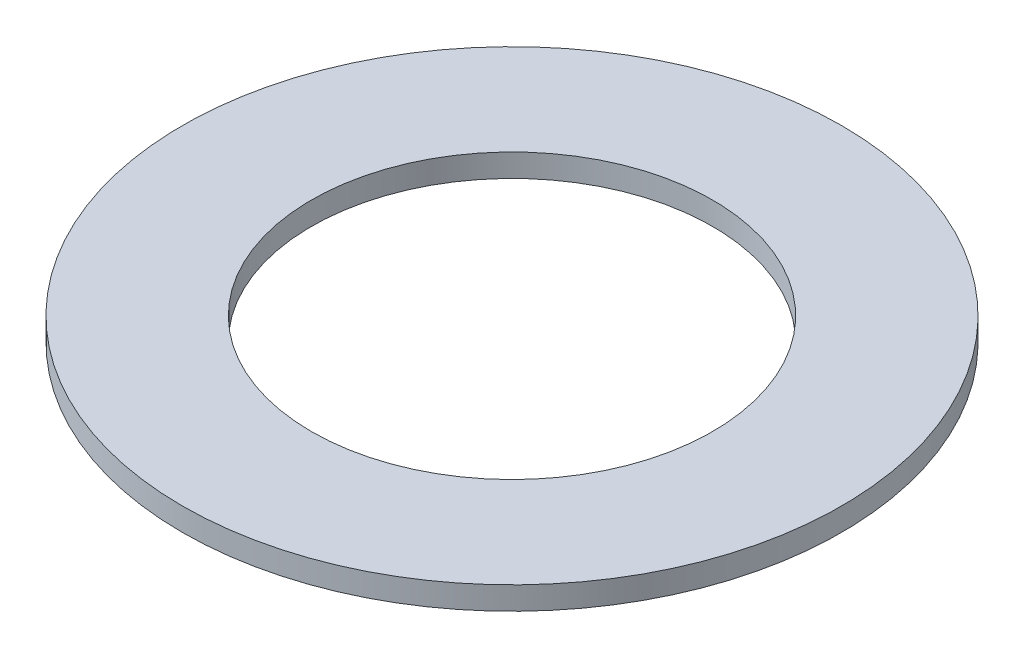
ISO-10303-21;
HEADER;
FILE_DESCRIPTION(('STEP AP214'),'2;1');
FILE_NAME('part.step','',(''),(''),'','','');
FILE_SCHEMA(('AUTOMOTIVE_DESIGN { 1 0 10303 214 1 1 1 1 }'));
ENDSEC;
DATA;
#1=APPLICATION_CONTEXT('core data for automotive mechanical design processes');
#2=APPLICATION_PROTOCOL_DEFINITION('international standard','automotive_design',2000,#1);
#3=PRODUCT_CONTEXT('',#1,'mechanical');
#4=PRODUCT('Part','Part','',(#3));
#5=PRODUCT_RELATED_PRODUCT_CATEGORY('part','',(#4));
#6=PRODUCT_DEFINITION_FORMATION('','',#4);
#7=PRODUCT_DEFINITION_CONTEXT('part definition',#1,'design');
#8=PRODUCT_DEFINITION('design','',#6,#7);
#9=PRODUCT_DEFINITION_SHAPE('','',#8);
#10=(LENGTH_UNIT() NAMED_UNIT(*) SI_UNIT(.MILLI.,.METRE.));
#11=(NAMED_UNIT(*) PLANE_ANGLE_UNIT() SI_UNIT($,.RADIAN.));
#12=(NAMED_UNIT(*) SI_UNIT($,.STERADIAN.) SOLID_ANGLE_UNIT());
#13=UNCERTAINTY_MEASURE_WITH_UNIT(LENGTH_MEASURE(1.E-05),#10,'distance_accuracy_value','');
#14=(GEOMETRIC_REPRESENTATION_CONTEXT(3) GLOBAL_UNCERTAINTY_ASSIGNED_CONTEXT((#13)) GLOBAL_UNIT_ASSIGNED_CONTEXT((#10,
#11,#12)) REPRESENTATION_CONTEXT('',''));
#15=CARTESIAN_POINT('',(0.,0.,0.));
#16=DIRECTION('',(0.,0.,1.));
#17=DIRECTION('',(1.,0.,0.));
#18=AXIS2_PLACEMENT_3D('',#15,#16,#17);
#19=CARTESIAN_POINT('',(0.,4.,0.));
#20=DIRECTION('',(0.,-1.,0.));
#21=DIRECTION('',(0.,0.,-1.));
#22=AXIS2_PLACEMENT_3D('',#19,#20,#21);
#23=CYLINDRICAL_SURFACE('',#22,57.5);
#24=CARTESIAN_POINT('',(0.,4.,0.));
#25=DIRECTION('',(0.,1.,0.));
#26=DIRECTION('',(0.,0.,1.));
#27=AXIS2_PLACEMENT_3D('',#24,#25,#26);
#28=CIRCLE('',#27,57.5);
#29=CARTESIAN_POINT('',(0.,4.,57.5));
#30=VERTEX_POINT('',#29);
#31=EDGE_CURVE('E10',#30,#30,#28,.T.);
#32=ORIENTED_EDGE('',*,*,#31,.F.);
#33=EDGE_LOOP('',(#32));
#34=FACE_BOUND('',#33,.T.);
#35=CARTESIAN_POINT('',(0.,0.,0.));
#36=DIRECTION('',(0.,1.,0.));
#37=DIRECTION('',(0.,0.,1.));
#38=AXIS2_PLACEMENT_3D('',#35,#36,#37);
#39=CIRCLE('',#38,57.5);
#40=CARTESIAN_POINT('',(0.,0.,57.5));
#41=VERTEX_POINT('',#40);
#42=EDGE_CURVE('E37',#41,#41,#39,.T.);
#43=ORIENTED_EDGE('',*,*,#42,.T.);
#44=EDGE_LOOP('',(#43));
#45=FACE_BOUND('',#44,.T.);
#46=ADVANCED_FACE('F40',(#34,#45),#23,.T.);
#47=CARTESIAN_POINT('',(0.,4.,0.));
#48=DIRECTION('',(0.,1.,0.));
#49=DIRECTION('',(0.,0.,1.));
#50=AXIS2_PLACEMENT_3D('',#47,#48,#49);
#51=PLANE('',#50);
#52=CARTESIAN_POINT('',(0.,4.,0.));
#53=DIRECTION('',(0.,1.,0.));
#54=DIRECTION('',(0.,0.,1.));
#55=AXIS2_PLACEMENT_3D('',#52,#53,#54);
#56=CIRCLE('',#55,35.);
#57=CARTESIAN_POINT('',(0.,4.,35.));
#58=VERTEX_POINT('',#57);
#59=EDGE_CURVE('E50',#58,#58,#56,.T.);
#60=ORIENTED_EDGE('',*,*,#59,.F.);
#61=EDGE_LOOP('',(#60));
#62=FACE_BOUND('',#61,.T.);
#63=ORIENTED_EDGE('',*,*,#31,.T.);
#64=EDGE_LOOP('',(#63));
#65=FACE_BOUND('',#64,.T.);
#66=ADVANCED_FACE('F59',(#62,#65),#51,.T.);
#67=CARTESIAN_POINT('',(0.,0.,0.));
#68=DIRECTION('',(0.,1.,0.));
#69=DIRECTION('',(0.,0.,1.));
#70=AXIS2_PLACEMENT_3D('',#67,#68,#69);
#71=PLANE('',#70);
#72=CARTESIAN_POINT('',(0.,0.,0.));
#73=DIRECTION('',(0.,1.,0.));
#74=DIRECTION('',(0.,0.,1.));
#75=AXIS2_PLACEMENT_3D('',#72,#73,#74);
#76=CIRCLE('',#75,35.);
#77=CARTESIAN_POINT('',(0.,0.,35.));
#78=VERTEX_POINT('',#77);
#79=EDGE_CURVE('E47',#78,#78,#76,.T.);
#80=ORIENTED_EDGE('',*,*,#79,.T.);
#81=EDGE_LOOP('',(#80));
#82=FACE_BOUND('',#81,.T.);
#83=ORIENTED_EDGE('',*,*,#42,.F.);
#84=EDGE_LOOP('',(#83));
#85=FACE_BOUND('',#84,.T.);
#86=ADVANCED_FACE('F58',(#82,#85),#71,.F.);
#87=CARTESIAN_POINT('',(0.,4.,0.));
#88=DIRECTION('',(0.,-1.,0.));
#89=DIRECTION('',(0.,0.,-1.));
#90=AXIS2_PLACEMENT_3D('',#87,#88,#89);
#91=CYLINDRICAL_SURFACE('',#90,35.);
#92=ORIENTED_EDGE('',*,*,#59,.T.);
#93=EDGE_LOOP('',(#92));
#94=FACE_BOUND('',#93,.T.);
#95=ORIENTED_EDGE('',*,*,#79,.F.);
#96=EDGE_LOOP('',(#95));
#97=FACE_BOUND('',#96,.T.);
#98=ADVANCED_FACE('F54',(#94,#97),#91,.F.);
#99=CLOSED_SHELL('',(#46,#66,#86,#98));
#100=MANIFOLD_SOLID_BREP('B2',#99);
#101=ADVANCED_BREP_SHAPE_REPRESENTATION('',(#18,#100),#14);
#102=SHAPE_DEFINITION_REPRESENTATION(#9,#101);
ENDSEC;
END-ISO-10303-21;
